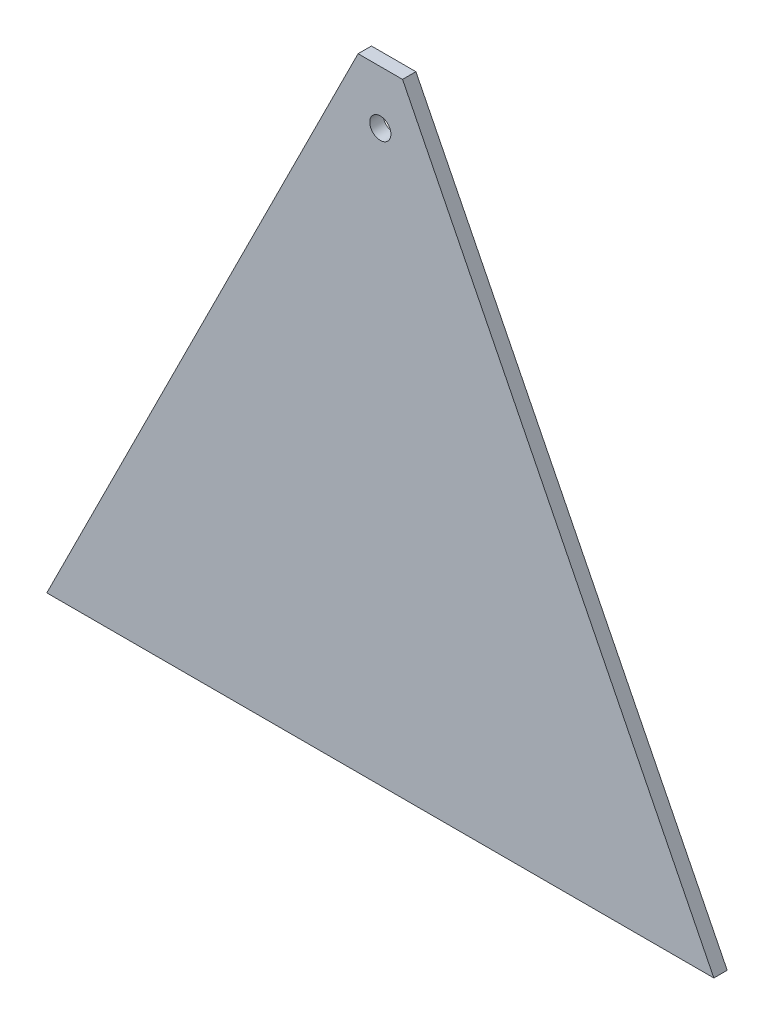
ISO-10303-21;
HEADER;
FILE_DESCRIPTION(('STEP AP214'),'2;1');
FILE_NAME('part.step','',(''),(''),'','','');
FILE_SCHEMA(('AUTOMOTIVE_DESIGN { 1 0 10303 214 1 1 1 1 }'));
ENDSEC;
DATA;
#1=APPLICATION_CONTEXT('core data for automotive mechanical design processes');
#2=APPLICATION_PROTOCOL_DEFINITION('international standard','automotive_design',2000,#1);
#3=PRODUCT_CONTEXT('',#1,'mechanical');
#4=PRODUCT('Part','Part','',(#3));
#5=PRODUCT_RELATED_PRODUCT_CATEGORY('part','',(#4));
#6=PRODUCT_DEFINITION_FORMATION('','',#4);
#7=PRODUCT_DEFINITION_CONTEXT('part definition',#1,'design');
#8=PRODUCT_DEFINITION('design','',#6,#7);
#9=PRODUCT_DEFINITION_SHAPE('','',#8);
#10=(LENGTH_UNIT() NAMED_UNIT(*) SI_UNIT(.MILLI.,.METRE.));
#11=(NAMED_UNIT(*) PLANE_ANGLE_UNIT() SI_UNIT($,.RADIAN.));
#12=(NAMED_UNIT(*) SI_UNIT($,.STERADIAN.) SOLID_ANGLE_UNIT());
#13=UNCERTAINTY_MEASURE_WITH_UNIT(LENGTH_MEASURE(1.E-05),#10,'distance_accuracy_value','');
#14=(GEOMETRIC_REPRESENTATION_CONTEXT(3) GLOBAL_UNCERTAINTY_ASSIGNED_CONTEXT((#13)) GLOBAL_UNIT_ASSIGNED_CONTEXT((#10,
#11,#12)) REPRESENTATION_CONTEXT('',''));
#15=CARTESIAN_POINT('',(0.,0.,0.));
#16=DIRECTION('',(0.,0.,1.));
#17=DIRECTION('',(1.,0.,0.));
#18=AXIS2_PLACEMENT_3D('',#15,#16,#17);
#19=CARTESIAN_POINT('',(75.,0.,3.));
#20=DIRECTION('',(-0.894427190999916,-0.447213595499958,0.));
#21=DIRECTION('',(0.447213595499958,-0.894427190999916,0.));
#22=AXIS2_PLACEMENT_3D('',#19,#20,#21);
#23=PLANE('',#22);
#24=DIRECTION('',(0.,0.,-1.));
#25=VECTOR('',#24,1.);
#26=CARTESIAN_POINT('',(5.00000000000001,140.,3.));
#27=LINE('',#26,#25);
#28=CARTESIAN_POINT('',(5.00000000000001,140.,3.));
#29=VERTEX_POINT('',#28);
#30=CARTESIAN_POINT('',(5.,140.,0.));
#31=VERTEX_POINT('',#30);
#32=EDGE_CURVE('E48',#29,#31,#27,.T.);
#33=ORIENTED_EDGE('',*,*,#32,.F.);
#34=DIRECTION('',(-0.447213595499958,0.894427190999916,0.));
#35=VECTOR('',#34,1.);
#36=CARTESIAN_POINT('',(75.,0.,3.));
#37=LINE('',#36,#35);
#38=CARTESIAN_POINT('',(75.,0.,3.));
#39=VERTEX_POINT('',#38);
#40=EDGE_CURVE('E77',#39,#29,#37,.T.);
#41=ORIENTED_EDGE('',*,*,#40,.F.);
#42=DIRECTION('',(0.,0.,-1.));
#43=VECTOR('',#42,1.);
#44=CARTESIAN_POINT('',(75.,0.,3.));
#45=LINE('',#44,#43);
#46=CARTESIAN_POINT('',(75.,0.,0.));
#47=VERTEX_POINT('',#46);
#48=EDGE_CURVE('E41',#39,#47,#45,.T.);
#49=ORIENTED_EDGE('',*,*,#48,.T.);
#50=DIRECTION('',(-0.447213595499958,0.894427190999916,0.));
#51=VECTOR('',#50,1.);
#52=CARTESIAN_POINT('',(75.,0.,0.));
#53=LINE('',#52,#51);
#54=EDGE_CURVE('E82',#47,#31,#53,.T.);
#55=ORIENTED_EDGE('',*,*,#54,.T.);
#56=EDGE_LOOP('',(#33,#41,#49,#55));
#57=FACE_BOUND('',#56,.T.);
#58=ADVANCED_FACE('F34',(#57),#23,.F.);
#59=CARTESIAN_POINT('',(-75.,0.,3.));
#60=DIRECTION('',(0.894427190999916,-0.447213595499958,0.));
#61=DIRECTION('',(0.447213595499958,0.894427190999916,0.));
#62=AXIS2_PLACEMENT_3D('',#59,#60,#61);
#63=PLANE('',#62);
#64=DIRECTION('',(0.,0.,-1.));
#65=VECTOR('',#64,1.);
#66=CARTESIAN_POINT('',(-5.,140.,3.));
#67=LINE('',#66,#65);
#68=CARTESIAN_POINT('',(-5.,140.,3.));
#69=VERTEX_POINT('',#68);
#70=CARTESIAN_POINT('',(-5.,140.,0.));
#71=VERTEX_POINT('',#70);
#72=EDGE_CURVE('E85',#69,#71,#67,.T.);
#73=ORIENTED_EDGE('',*,*,#72,.T.);
#74=DIRECTION('',(-0.447213595499958,-0.894427190999916,0.));
#75=VECTOR('',#74,1.);
#76=CARTESIAN_POINT('',(-75.,0.,0.));
#77=LINE('',#76,#75);
#78=CARTESIAN_POINT('',(-75.,0.,0.));
#79=VERTEX_POINT('',#78);
#80=EDGE_CURVE('E78',#71,#79,#77,.T.);
#81=ORIENTED_EDGE('',*,*,#80,.T.);
#82=DIRECTION('',(0.,0.,-1.));
#83=VECTOR('',#82,1.);
#84=CARTESIAN_POINT('',(-75.,0.,3.));
#85=LINE('',#84,#83);
#86=CARTESIAN_POINT('',(-75.,0.,3.));
#87=VERTEX_POINT('',#86);
#88=EDGE_CURVE('E11',#87,#79,#85,.T.);
#89=ORIENTED_EDGE('',*,*,#88,.F.);
#90=DIRECTION('',(-0.447213595499958,-0.894427190999916,0.));
#91=VECTOR('',#90,1.);
#92=CARTESIAN_POINT('',(-75.,0.,3.));
#93=LINE('',#92,#91);
#94=EDGE_CURVE('E92',#69,#87,#93,.T.);
#95=ORIENTED_EDGE('',*,*,#94,.F.);
#96=EDGE_LOOP('',(#73,#81,#89,#95));
#97=FACE_BOUND('',#96,.T.);
#98=ADVANCED_FACE('F111',(#97),#63,.F.);
#99=CARTESIAN_POINT('',(0.,0.,3.));
#100=DIRECTION('',(0.,0.,1.));
#101=DIRECTION('',(1.,0.,0.));
#102=AXIS2_PLACEMENT_3D('',#99,#100,#101);
#103=PLANE('',#102);
#104=CARTESIAN_POINT('',(0.,128.,3.));
#105=DIRECTION('',(0.,0.,1.));
#106=DIRECTION('',(1.,0.,0.));
#107=AXIS2_PLACEMENT_3D('',#104,#105,#106);
#108=CIRCLE('',#107,2.38125);
#109=CARTESIAN_POINT('',(2.38125,128.,3.));
#110=VERTEX_POINT('',#109);
#111=EDGE_CURVE('E98',#110,#110,#108,.T.);
#112=ORIENTED_EDGE('',*,*,#111,.F.);
#113=EDGE_LOOP('',(#112));
#114=FACE_BOUND('',#113,.T.);
#115=ORIENTED_EDGE('',*,*,#40,.T.);
#116=DIRECTION('',(1.,0.,0.));
#117=VECTOR('',#116,1.);
#118=CARTESIAN_POINT('',(-5.,140.,3.));
#119=LINE('',#118,#117);
#120=EDGE_CURVE('E96',#69,#29,#119,.T.);
#121=ORIENTED_EDGE('',*,*,#120,.F.);
#122=ORIENTED_EDGE('',*,*,#94,.T.);
#123=DIRECTION('',(1.,0.,0.));
#124=VECTOR('',#123,1.);
#125=CARTESIAN_POINT('',(75.,0.,3.));
#126=LINE('',#125,#124);
#127=EDGE_CURVE('E57',#87,#39,#126,.T.);
#128=ORIENTED_EDGE('',*,*,#127,.T.);
#129=EDGE_LOOP('',(#115,#121,#122,#128));
#130=FACE_BOUND('',#129,.T.);
#131=ADVANCED_FACE('F109',(#114,#130),#103,.T.);
#132=CARTESIAN_POINT('',(0.,0.,0.));
#133=DIRECTION('',(0.,0.,1.));
#134=DIRECTION('',(1.,0.,0.));
#135=AXIS2_PLACEMENT_3D('',#132,#133,#134);
#136=PLANE('',#135);
#137=CARTESIAN_POINT('',(0.,128.,0.));
#138=DIRECTION('',(0.,0.,1.));
#139=DIRECTION('',(1.,0.,0.));
#140=AXIS2_PLACEMENT_3D('',#137,#138,#139);
#141=CIRCLE('',#140,2.38125);
#142=CARTESIAN_POINT('',(2.38125,128.,0.));
#143=VERTEX_POINT('',#142);
#144=EDGE_CURVE('E100',#143,#143,#141,.T.);
#145=ORIENTED_EDGE('',*,*,#144,.T.);
#146=EDGE_LOOP('',(#145));
#147=FACE_BOUND('',#146,.T.);
#148=DIRECTION('',(1.,0.,0.));
#149=VECTOR('',#148,1.);
#150=CARTESIAN_POINT('',(-5.,140.,0.));
#151=LINE('',#150,#149);
#152=EDGE_CURVE('E84',#71,#31,#151,.T.);
#153=ORIENTED_EDGE('',*,*,#152,.T.);
#154=ORIENTED_EDGE('',*,*,#54,.F.);
#155=DIRECTION('',(1.,0.,0.));
#156=VECTOR('',#155,1.);
#157=CARTESIAN_POINT('',(75.,0.,0.));
#158=LINE('',#157,#156);
#159=EDGE_CURVE('E69',#79,#47,#158,.T.);
#160=ORIENTED_EDGE('',*,*,#159,.F.);
#161=ORIENTED_EDGE('',*,*,#80,.F.);
#162=EDGE_LOOP('',(#153,#154,#160,#161));
#163=FACE_BOUND('',#162,.T.);
#164=ADVANCED_FACE('F83',(#147,#163),#136,.F.);
#165=CARTESIAN_POINT('',(75.,0.,3.));
#166=DIRECTION('',(0.,1.,0.));
#167=DIRECTION('',(-1.,0.,0.));
#168=AXIS2_PLACEMENT_3D('',#165,#166,#167);
#169=PLANE('',#168);
#170=ORIENTED_EDGE('',*,*,#159,.T.);
#171=ORIENTED_EDGE('',*,*,#48,.F.);
#172=ORIENTED_EDGE('',*,*,#127,.F.);
#173=ORIENTED_EDGE('',*,*,#88,.T.);
#174=EDGE_LOOP('',(#170,#171,#172,#173));
#175=FACE_BOUND('',#174,.T.);
#176=ADVANCED_FACE('F71',(#175),#169,.F.);
#177=CARTESIAN_POINT('',(-5.,140.,3.));
#178=DIRECTION('',(0.,1.,0.));
#179=DIRECTION('',(0.,0.,1.));
#180=AXIS2_PLACEMENT_3D('',#177,#178,#179);
#181=PLANE('',#180);
#182=ORIENTED_EDGE('',*,*,#152,.F.);
#183=ORIENTED_EDGE('',*,*,#72,.F.);
#184=ORIENTED_EDGE('',*,*,#120,.T.);
#185=ORIENTED_EDGE('',*,*,#32,.T.);
#186=EDGE_LOOP('',(#182,#183,#184,#185));
#187=FACE_BOUND('',#186,.T.);
#188=ADVANCED_FACE('F120',(#187),#181,.T.);
#189=CARTESIAN_POINT('',(0.,128.,3.));
#190=DIRECTION('',(0.,0.,-1.));
#191=DIRECTION('',(-1.,0.,0.));
#192=AXIS2_PLACEMENT_3D('',#189,#190,#191);
#193=CYLINDRICAL_SURFACE('',#192,2.38125);
#194=ORIENTED_EDGE('',*,*,#111,.T.);
#195=EDGE_LOOP('',(#194));
#196=FACE_BOUND('',#195,.T.);
#197=ORIENTED_EDGE('',*,*,#144,.F.);
#198=EDGE_LOOP('',(#197));
#199=FACE_BOUND('',#198,.T.);
#200=ADVANCED_FACE('F106',(#196,#199),#193,.F.);
#201=CLOSED_SHELL('',(#58,#98,#131,#164,#176,#188,#200));
#202=MANIFOLD_SOLID_BREP('B2',#201);
#203=ADVANCED_BREP_SHAPE_REPRESENTATION('',(#18,#202),#14);
#204=SHAPE_DEFINITION_REPRESENTATION(#9,#203);
ENDSEC;
END-ISO-10303-21;
